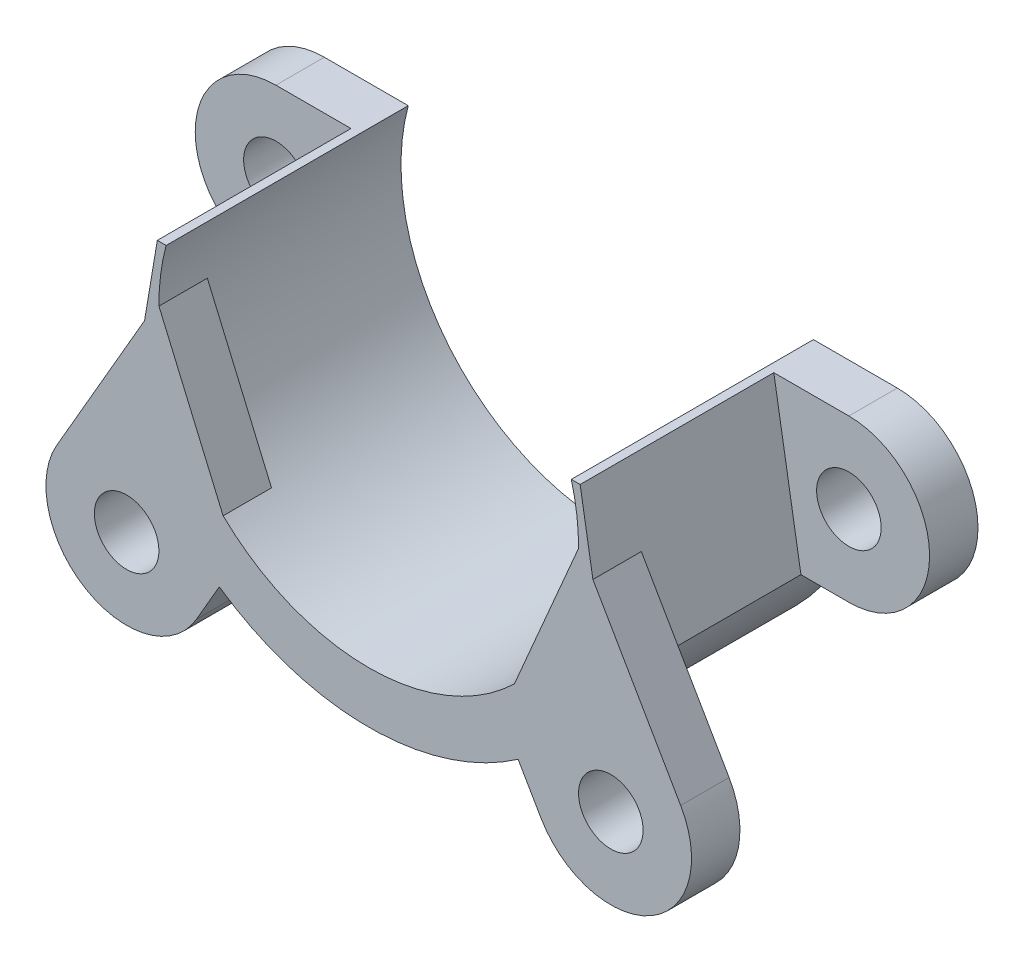
ISO-10303-21;
HEADER;
FILE_DESCRIPTION(('STEP AP214'),'2;1');
FILE_NAME('part.step','',(''),(''),'','','');
FILE_SCHEMA(('AUTOMOTIVE_DESIGN { 1 0 10303 214 1 1 1 1 }'));
ENDSEC;
DATA;
#1=APPLICATION_CONTEXT('core data for automotive mechanical design processes');
#2=APPLICATION_PROTOCOL_DEFINITION('international standard','automotive_design',2000,#1);
#3=PRODUCT_CONTEXT('',#1,'mechanical');
#4=PRODUCT('Part','Part','',(#3));
#5=PRODUCT_RELATED_PRODUCT_CATEGORY('part','',(#4));
#6=PRODUCT_DEFINITION_FORMATION('','',#4);
#7=PRODUCT_DEFINITION_CONTEXT('part definition',#1,'design');
#8=PRODUCT_DEFINITION('design','',#6,#7);
#9=PRODUCT_DEFINITION_SHAPE('','',#8);
#10=(LENGTH_UNIT() NAMED_UNIT(*) SI_UNIT(.MILLI.,.METRE.));
#11=(NAMED_UNIT(*) PLANE_ANGLE_UNIT() SI_UNIT($,.RADIAN.));
#12=(NAMED_UNIT(*) SI_UNIT($,.STERADIAN.) SOLID_ANGLE_UNIT());
#13=UNCERTAINTY_MEASURE_WITH_UNIT(LENGTH_MEASURE(1.E-05),#10,'distance_accuracy_value','');
#14=(GEOMETRIC_REPRESENTATION_CONTEXT(3) GLOBAL_UNCERTAINTY_ASSIGNED_CONTEXT((#13)) GLOBAL_UNIT_ASSIGNED_CONTEXT((#10,
#11,#12)) REPRESENTATION_CONTEXT('',''));
#15=CARTESIAN_POINT('',(0.,0.,0.));
#16=DIRECTION('',(0.,0.,1.));
#17=DIRECTION('',(1.,0.,0.));
#18=AXIS2_PLACEMENT_3D('',#15,#16,#17);
#19=CARTESIAN_POINT('',(0.,0.,3.));
#20=DIRECTION('',(0.,0.,1.));
#21=DIRECTION('',(1.,0.,0.));
#22=AXIS2_PLACEMENT_3D('',#19,#20,#21);
#23=PLANE('',#22);
#24=DIRECTION('',(-0.165720786741634,-0.986172713494819,0.));
#25=VECTOR('',#24,1.);
#26=CARTESIAN_POINT('',(-14.7795611567183,-6.61707257474387,3.));
#27=LINE('',#26,#25);
#28=CARTESIAN_POINT('',(-13.0991173107884,3.38292742525613,3.));
#29=VERTEX_POINT('',#28);
#30=CARTESIAN_POINT('',(-14.7795611567183,-6.61707257474387,3.));
#31=VERTEX_POINT('',#30);
#32=EDGE_CURVE('E293',#29,#31,#27,.T.);
#33=ORIENTED_EDGE('',*,*,#32,.F.);
#34=DIRECTION('',(-1.,0.,0.));
#35=VECTOR('',#34,1.);
#36=CARTESIAN_POINT('',(-13.0991173107884,3.38292742525613,3.));
#37=LINE('',#36,#35);
#38=CARTESIAN_POINT('',(-17.75,3.38292742525613,3.));
#39=VERTEX_POINT('',#38);
#40=EDGE_CURVE('E341',#29,#39,#37,.T.);
#41=ORIENTED_EDGE('',*,*,#40,.T.);
#42=CARTESIAN_POINT('',(-17.75,-1.61707257474387,3.));
#43=DIRECTION('',(0.,0.,1.));
#44=DIRECTION('',(1.,0.,0.));
#45=AXIS2_PLACEMENT_3D('',#42,#43,#44);
#46=CIRCLE('',#45,5.);
#47=CARTESIAN_POINT('',(-17.75,-6.61707257474387,3.));
#48=VERTEX_POINT('',#47);
#49=EDGE_CURVE('E343',#39,#48,#46,.T.);
#50=ORIENTED_EDGE('',*,*,#49,.T.);
#51=DIRECTION('',(1.,0.,0.));
#52=VECTOR('',#51,1.);
#53=CARTESIAN_POINT('',(-17.75,-6.61707257474387,3.));
#54=LINE('',#53,#52);
#55=EDGE_CURVE('E345',#48,#31,#54,.T.);
#56=ORIENTED_EDGE('',*,*,#55,.T.);
#57=EDGE_LOOP('',(#33,#41,#50,#56));
#58=FACE_BOUND('',#57,.T.);
#59=CARTESIAN_POINT('',(-17.75,-1.61707257474387,3.));
#60=DIRECTION('',(0.,0.,1.));
#61=DIRECTION('',(1.,0.,0.));
#62=AXIS2_PLACEMENT_3D('',#59,#60,#61);
#63=CIRCLE('',#62,2.);
#64=CARTESIAN_POINT('',(-15.75,-1.61707257474387,3.));
#65=VERTEX_POINT('',#64);
#66=EDGE_CURVE('E328',#65,#65,#63,.T.);
#67=ORIENTED_EDGE('',*,*,#66,.F.);
#68=EDGE_LOOP('',(#67));
#69=FACE_BOUND('',#68,.T.);
#70=ADVANCED_FACE('F32',(#58,#69),#23,.T.);
#71=DIRECTION('',(-0.165720786741634,0.986172713494819,0.));
#72=VECTOR('',#71,1.);
#73=CARTESIAN_POINT('',(13.0991173107884,3.38292742525613,3.));
#74=LINE('',#73,#72);
#75=CARTESIAN_POINT('',(14.7795611567183,-6.61707257474387,3.));
#76=VERTEX_POINT('',#75);
#77=CARTESIAN_POINT('',(13.0991173107884,3.38292742525613,3.));
#78=VERTEX_POINT('',#77);
#79=EDGE_CURVE('E289',#76,#78,#74,.T.);
#80=ORIENTED_EDGE('',*,*,#79,.F.);
#81=DIRECTION('',(1.,0.,0.));
#82=VECTOR('',#81,1.);
#83=CARTESIAN_POINT('',(14.7795611567183,-6.61707257474387,3.));
#84=LINE('',#83,#82);
#85=CARTESIAN_POINT('',(17.75,-6.61707257474387,3.));
#86=VERTEX_POINT('',#85);
#87=EDGE_CURVE('E334',#76,#86,#84,.T.);
#88=ORIENTED_EDGE('',*,*,#87,.T.);
#89=CARTESIAN_POINT('',(17.75,-1.61707257474387,3.));
#90=DIRECTION('',(0.,0.,1.));
#91=DIRECTION('',(1.,0.,0.));
#92=AXIS2_PLACEMENT_3D('',#89,#90,#91);
#93=CIRCLE('',#92,5.);
#94=CARTESIAN_POINT('',(17.75,3.38292742525613,3.));
#95=VERTEX_POINT('',#94);
#96=EDGE_CURVE('E336',#86,#95,#93,.T.);
#97=ORIENTED_EDGE('',*,*,#96,.T.);
#98=DIRECTION('',(-1.,0.,0.));
#99=VECTOR('',#98,1.);
#100=CARTESIAN_POINT('',(17.75,3.38292742525613,3.));
#101=LINE('',#100,#99);
#102=EDGE_CURVE('E339',#95,#78,#101,.T.);
#103=ORIENTED_EDGE('',*,*,#102,.T.);
#104=EDGE_LOOP('',(#80,#88,#97,#103));
#105=FACE_BOUND('',#104,.T.);
#106=CARTESIAN_POINT('',(17.75,-1.61707257474387,3.));
#107=DIRECTION('',(0.,0.,1.));
#108=DIRECTION('',(1.,0.,0.));
#109=AXIS2_PLACEMENT_3D('',#106,#107,#108);
#110=CIRCLE('',#109,2.);
#111=CARTESIAN_POINT('',(19.75,-1.61707257474387,3.));
#112=VERTEX_POINT('',#111);
#113=EDGE_CURVE('E322',#112,#112,#110,.T.);
#114=ORIENTED_EDGE('',*,*,#113,.F.);
#115=EDGE_LOOP('',(#114));
#116=FACE_BOUND('',#115,.T.);
#117=ADVANCED_FACE('F420',(#105,#116),#23,.T.);
#118=CARTESIAN_POINT('',(0.,0.,0.));
#119=DIRECTION('',(0.,0.,1.));
#120=DIRECTION('',(1.,0.,0.));
#121=AXIS2_PLACEMENT_3D('',#118,#119,#120);
#122=PLANE('',#121);
#123=CARTESIAN_POINT('',(0.,0.,0.));
#124=DIRECTION('',(0.,0.,1.));
#125=DIRECTION('',(1.,0.,0.));
#126=AXIS2_PLACEMENT_3D('',#123,#124,#125);
#127=CIRCLE('',#126,16.1932417213047);
#128=CARTESIAN_POINT('',(-14.7795611567183,-6.61707257474387,0.));
#129=VERTEX_POINT('',#128);
#130=CARTESIAN_POINT('',(14.7795611567183,-6.61707257474387,0.));
#131=VERTEX_POINT('',#130);
#132=EDGE_CURVE('E331',#129,#131,#127,.T.);
#133=ORIENTED_EDGE('',*,*,#132,.F.);
#134=DIRECTION('',(1.,0.,0.));
#135=VECTOR('',#134,1.);
#136=CARTESIAN_POINT('',(-17.75,-6.61707257474387,0.));
#137=LINE('',#136,#135);
#138=CARTESIAN_POINT('',(-17.75,-6.61707257474387,0.));
#139=VERTEX_POINT('',#138);
#140=EDGE_CURVE('E337',#139,#129,#137,.T.);
#141=ORIENTED_EDGE('',*,*,#140,.F.);
#142=CARTESIAN_POINT('',(-17.75,-1.61707257474387,0.));
#143=DIRECTION('',(0.,0.,1.));
#144=DIRECTION('',(1.,0.,0.));
#145=AXIS2_PLACEMENT_3D('',#142,#143,#144);
#146=CIRCLE('',#145,5.);
#147=CARTESIAN_POINT('',(-17.75,3.38292742525613,0.));
#148=VERTEX_POINT('',#147);
#149=EDGE_CURVE('E363',#148,#139,#146,.T.);
#150=ORIENTED_EDGE('',*,*,#149,.F.);
#151=DIRECTION('',(-1.,0.,0.));
#152=VECTOR('',#151,1.);
#153=CARTESIAN_POINT('',(-17.75,3.38292742525613,0.));
#154=LINE('',#153,#152);
#155=CARTESIAN_POINT('',(-12.5521234074339,3.38292742525613,0.));
#156=VERTEX_POINT('',#155);
#157=EDGE_CURVE('E361',#156,#148,#154,.T.);
#158=ORIENTED_EDGE('',*,*,#157,.F.);
#159=CARTESIAN_POINT('',(0.,0.,0.));
#160=DIRECTION('',(0.,0.,-1.));
#161=DIRECTION('',(1.,0.,0.));
#162=AXIS2_PLACEMENT_3D('',#159,#160,#161);
#163=CIRCLE('',#162,13.);
#164=CARTESIAN_POINT('',(12.5521234074339,3.38292742525613,0.));
#165=VERTEX_POINT('',#164);
#166=EDGE_CURVE('E358',#165,#156,#163,.T.);
#167=ORIENTED_EDGE('',*,*,#166,.F.);
#168=DIRECTION('',(-1.,0.,0.));
#169=VECTOR('',#168,1.);
#170=CARTESIAN_POINT('',(12.5521234074339,3.38292742525613,0.));
#171=LINE('',#170,#169);
#172=CARTESIAN_POINT('',(17.75,3.38292742525613,0.));
#173=VERTEX_POINT('',#172);
#174=EDGE_CURVE('E356',#173,#165,#171,.T.);
#175=ORIENTED_EDGE('',*,*,#174,.F.);
#176=CARTESIAN_POINT('',(17.75,-1.61707257474387,0.));
#177=DIRECTION('',(0.,0.,1.));
#178=DIRECTION('',(1.,0.,0.));
#179=AXIS2_PLACEMENT_3D('',#176,#177,#178);
#180=CIRCLE('',#179,5.);
#181=CARTESIAN_POINT('',(17.75,-6.61707257474387,0.));
#182=VERTEX_POINT('',#181);
#183=EDGE_CURVE('E353',#182,#173,#180,.T.);
#184=ORIENTED_EDGE('',*,*,#183,.F.);
#185=DIRECTION('',(1.,0.,0.));
#186=VECTOR('',#185,1.);
#187=CARTESIAN_POINT('',(14.7795611567183,-6.61707257474387,0.));
#188=LINE('',#187,#186);
#189=EDGE_CURVE('E351',#131,#182,#188,.T.);
#190=ORIENTED_EDGE('',*,*,#189,.F.);
#191=EDGE_LOOP('',(#133,#141,#150,#158,#167,#175,#184,#190));
#192=FACE_BOUND('',#191,.T.);
#193=CARTESIAN_POINT('',(-17.75,-1.61707257474387,0.));
#194=DIRECTION('',(0.,0.,1.));
#195=DIRECTION('',(1.,0.,0.));
#196=AXIS2_PLACEMENT_3D('',#193,#194,#195);
#197=CIRCLE('',#196,2.);
#198=CARTESIAN_POINT('',(-15.75,-1.61707257474387,0.));
#199=VERTEX_POINT('',#198);
#200=EDGE_CURVE('E325',#199,#199,#197,.T.);
#201=ORIENTED_EDGE('',*,*,#200,.T.);
#202=EDGE_LOOP('',(#201));
#203=FACE_BOUND('',#202,.T.);
#204=CARTESIAN_POINT('',(17.75,-1.61707257474387,0.));
#205=DIRECTION('',(0.,0.,1.));
#206=DIRECTION('',(1.,0.,0.));
#207=AXIS2_PLACEMENT_3D('',#204,#205,#206);
#208=CIRCLE('',#207,2.);
#209=CARTESIAN_POINT('',(19.75,-1.61707257474387,0.));
#210=VERTEX_POINT('',#209);
#211=EDGE_CURVE('E321',#210,#210,#208,.T.);
#212=ORIENTED_EDGE('',*,*,#211,.T.);
#213=EDGE_LOOP('',(#212));
#214=FACE_BOUND('',#213,.T.);
#215=ADVANCED_FACE('F439',(#192,#203,#214),#122,.F.);
#216=CARTESIAN_POINT('',(0.,0.,3.));
#217=DIRECTION('',(0.,0.,-1.));
#218=DIRECTION('',(-1.,0.,0.));
#219=AXIS2_PLACEMENT_3D('',#216,#217,#218);
#220=CYLINDRICAL_SURFACE('',#219,16.1932417213047);
#221=CARTESIAN_POINT('',(0.,0.,15.));
#222=DIRECTION('',(0.,0.,1.));
#223=DIRECTION('',(1.,0.,0.));
#224=AXIS2_PLACEMENT_3D('',#221,#222,#223);
#225=CIRCLE('',#224,16.1932417213047);
#226=CARTESIAN_POINT('',(-9.25730314163379,-13.2862114987118,15.));
#227=VERTEX_POINT('',#226);
#228=CARTESIAN_POINT('',(9.25730314163379,-13.2862114987118,15.));
#229=VERTEX_POINT('',#228);
#230=EDGE_CURVE('E290',#227,#229,#225,.T.);
#231=ORIENTED_EDGE('',*,*,#230,.F.);
#232=DIRECTION('',(0.,0.,-1.));
#233=VECTOR('',#232,1.);
#234=CARTESIAN_POINT('',(-9.25730314163378,-13.2862114987118,3.));
#235=LINE('',#234,#233);
#236=CARTESIAN_POINT('',(-9.25730314163378,-13.2862114987118,12.));
#237=VERTEX_POINT('',#236);
#238=EDGE_CURVE('E227',#227,#237,#235,.T.);
#239=ORIENTED_EDGE('',*,*,#238,.T.);
#240=CARTESIAN_POINT('',(0.,0.,12.));
#241=DIRECTION('',(0.,0.,-1.));
#242=DIRECTION('',(-1.,0.,0.));
#243=AXIS2_PLACEMENT_3D('',#240,#241,#242);
#244=CIRCLE('',#243,16.1932417213047);
#245=CARTESIAN_POINT('',(-14.7795611567183,-6.61707257474387,12.));
#246=VERTEX_POINT('',#245);
#247=EDGE_CURVE('E206',#237,#246,#244,.T.);
#248=ORIENTED_EDGE('',*,*,#247,.T.);
#249=DIRECTION('',(0.,0.,-1.));
#250=VECTOR('',#249,1.);
#251=CARTESIAN_POINT('',(-14.7795611567183,-6.61707257474387,15.));
#252=LINE('',#251,#250);
#253=EDGE_CURVE('E307',#246,#31,#252,.T.);
#254=ORIENTED_EDGE('',*,*,#253,.T.);
#255=DIRECTION('',(0.,0.,-1.));
#256=VECTOR('',#255,1.);
#257=CARTESIAN_POINT('',(-14.7795611567183,-6.61707257474387,3.));
#258=LINE('',#257,#256);
#259=EDGE_CURVE('E348',#31,#129,#258,.T.);
#260=ORIENTED_EDGE('',*,*,#259,.T.);
#261=ORIENTED_EDGE('',*,*,#132,.T.);
#262=DIRECTION('',(0.,0.,-1.));
#263=VECTOR('',#262,1.);
#264=CARTESIAN_POINT('',(14.7795611567183,-6.61707257474387,3.));
#265=LINE('',#264,#263);
#266=EDGE_CURVE('E386',#76,#131,#265,.T.);
#267=ORIENTED_EDGE('',*,*,#266,.F.);
#268=DIRECTION('',(0.,0.,-1.));
#269=VECTOR('',#268,1.);
#270=CARTESIAN_POINT('',(14.7795611567183,-6.61707257474387,15.));
#271=LINE('',#270,#269);
#272=CARTESIAN_POINT('',(14.7795611567183,-6.61707257474387,12.));
#273=VERTEX_POINT('',#272);
#274=EDGE_CURVE('E319',#273,#76,#271,.T.);
#275=ORIENTED_EDGE('',*,*,#274,.F.);
#276=CARTESIAN_POINT('',(0.,0.,12.));
#277=DIRECTION('',(0.,0.,1.));
#278=DIRECTION('',(1.,0.,0.));
#279=AXIS2_PLACEMENT_3D('',#276,#277,#278);
#280=CIRCLE('',#279,16.1932417213047);
#281=CARTESIAN_POINT('',(9.25730314163378,-13.2862114987118,12.));
#282=VERTEX_POINT('',#281);
#283=EDGE_CURVE('E285',#282,#273,#280,.T.);
#284=ORIENTED_EDGE('',*,*,#283,.F.);
#285=DIRECTION('',(0.,0.,-1.));
#286=VECTOR('',#285,1.);
#287=CARTESIAN_POINT('',(9.25730314163378,-13.2862114987118,3.));
#288=LINE('',#287,#286);
#289=EDGE_CURVE('E279',#282,#229,#288,.F.);
#290=ORIENTED_EDGE('',*,*,#289,.T.);
#291=EDGE_LOOP('',(#231,#239,#248,#254,#260,#261,#267,#275,#284,#290));
#292=FACE_BOUND('',#291,.T.);
#293=ADVANCED_FACE('F34',(#292),#220,.T.);
#294=CARTESIAN_POINT('',(14.7795611567183,-6.61707257474387,3.));
#295=DIRECTION('',(0.,1.,0.));
#296=DIRECTION('',(0.,0.,1.));
#297=AXIS2_PLACEMENT_3D('',#294,#295,#296);
#298=PLANE('',#297);
#299=ORIENTED_EDGE('',*,*,#189,.T.);
#300=DIRECTION('',(0.,0.,-1.));
#301=VECTOR('',#300,1.);
#302=CARTESIAN_POINT('',(17.75,-6.61707257474387,3.));
#303=LINE('',#302,#301);
#304=EDGE_CURVE('E383',#86,#182,#303,.T.);
#305=ORIENTED_EDGE('',*,*,#304,.F.);
#306=ORIENTED_EDGE('',*,*,#87,.F.);
#307=ORIENTED_EDGE('',*,*,#266,.T.);
#308=EDGE_LOOP('',(#299,#305,#306,#307));
#309=FACE_BOUND('',#308,.T.);
#310=ADVANCED_FACE('F425',(#309),#298,.F.);
#311=CARTESIAN_POINT('',(17.75,-1.61707257474387,3.));
#312=DIRECTION('',(0.,0.,-1.));
#313=DIRECTION('',(-1.,0.,0.));
#314=AXIS2_PLACEMENT_3D('',#311,#312,#313);
#315=CYLINDRICAL_SURFACE('',#314,5.);
#316=ORIENTED_EDGE('',*,*,#183,.T.);
#317=DIRECTION('',(0.,0.,-1.));
#318=VECTOR('',#317,1.);
#319=CARTESIAN_POINT('',(17.75,3.38292742525613,3.));
#320=LINE('',#319,#318);
#321=EDGE_CURVE('E380',#95,#173,#320,.T.);
#322=ORIENTED_EDGE('',*,*,#321,.F.);
#323=ORIENTED_EDGE('',*,*,#96,.F.);
#324=ORIENTED_EDGE('',*,*,#304,.T.);
#325=EDGE_LOOP('',(#316,#322,#323,#324));
#326=FACE_BOUND('',#325,.T.);
#327=ADVANCED_FACE('F430',(#326),#315,.T.);
#328=CARTESIAN_POINT('',(12.5521234074339,3.38292742525613,3.));
#329=DIRECTION('',(0.,-1.,0.));
#330=DIRECTION('',(0.,0.,-1.));
#331=AXIS2_PLACEMENT_3D('',#328,#329,#330);
#332=PLANE('',#331);
#333=ORIENTED_EDGE('',*,*,#174,.T.);
#334=DIRECTION('',(0.,0.,-1.));
#335=VECTOR('',#334,1.);
#336=CARTESIAN_POINT('',(12.5521234074339,3.38292742525613,3.));
#337=LINE('',#336,#335);
#338=CARTESIAN_POINT('',(12.5521234074339,3.38292742525613,15.));
#339=VERTEX_POINT('',#338);
#340=EDGE_CURVE('E377',#339,#165,#337,.T.);
#341=ORIENTED_EDGE('',*,*,#340,.F.);
#342=DIRECTION('',(-1.,0.,0.));
#343=VECTOR('',#342,1.);
#344=CARTESIAN_POINT('',(12.5521234074339,3.38292742525613,15.));
#345=LINE('',#344,#343);
#346=CARTESIAN_POINT('',(13.0991173107884,3.38292742525613,15.));
#347=VERTEX_POINT('',#346);
#348=EDGE_CURVE('E295',#347,#339,#345,.T.);
#349=ORIENTED_EDGE('',*,*,#348,.F.);
#350=DIRECTION('',(0.,0.,-1.));
#351=VECTOR('',#350,1.);
#352=CARTESIAN_POINT('',(13.0991173107884,3.38292742525613,15.));
#353=LINE('',#352,#351);
#354=EDGE_CURVE('E316',#347,#78,#353,.T.);
#355=ORIENTED_EDGE('',*,*,#354,.T.);
#356=ORIENTED_EDGE('',*,*,#102,.F.);
#357=ORIENTED_EDGE('',*,*,#321,.T.);
#358=EDGE_LOOP('',(#333,#341,#349,#355,#356,#357));
#359=FACE_BOUND('',#358,.T.);
#360=ADVANCED_FACE('F432',(#359),#332,.F.);
#361=CARTESIAN_POINT('',(0.,0.,3.));
#362=DIRECTION('',(0.,0.,-1.));
#363=DIRECTION('',(-1.,0.,0.));
#364=AXIS2_PLACEMENT_3D('',#361,#362,#363);
#365=CYLINDRICAL_SURFACE('',#364,13.);
#366=CARTESIAN_POINT('',(0.,0.,12.));
#367=DIRECTION('',(0.,0.,-1.));
#368=DIRECTION('',(-1.,0.,0.));
#369=AXIS2_PLACEMENT_3D('',#366,#367,#368);
#370=CIRCLE('',#369,13.);
#371=CARTESIAN_POINT('',(-12.9996375756716,-0.0970716291515588,12.));
#372=VERTEX_POINT('',#371);
#373=CARTESIAN_POINT('',(-9.02238954104811,-9.35929949139281,12.));
#374=VERTEX_POINT('',#373);
#375=EDGE_CURVE('E240',#372,#374,#370,.F.);
#376=ORIENTED_EDGE('',*,*,#375,.T.);
#377=DIRECTION('',(0.,0.,-1.));
#378=VECTOR('',#377,1.);
#379=CARTESIAN_POINT('',(-9.02238954104811,-9.35929949139281,3.));
#380=LINE('',#379,#378);
#381=CARTESIAN_POINT('',(-9.02238954104811,-9.35929949139281,15.));
#382=VERTEX_POINT('',#381);
#383=EDGE_CURVE('E233',#374,#382,#380,.F.);
#384=ORIENTED_EDGE('',*,*,#383,.T.);
#385=CARTESIAN_POINT('',(0.,0.,15.));
#386=DIRECTION('',(0.,0.,-1.));
#387=DIRECTION('',(1.,0.,0.));
#388=AXIS2_PLACEMENT_3D('',#385,#386,#387);
#389=CIRCLE('',#388,13.);
#390=CARTESIAN_POINT('',(9.02238954104811,-9.35929949139281,15.));
#391=VERTEX_POINT('',#390);
#392=EDGE_CURVE('E302',#391,#382,#389,.T.);
#393=ORIENTED_EDGE('',*,*,#392,.F.);
#394=DIRECTION('',(0.,0.,-1.));
#395=VECTOR('',#394,1.);
#396=CARTESIAN_POINT('',(9.02238954104811,-9.35929949139281,3.));
#397=LINE('',#396,#395);
#398=CARTESIAN_POINT('',(9.02238954104811,-9.35929949139281,12.));
#399=VERTEX_POINT('',#398);
#400=EDGE_CURVE('E271',#391,#399,#397,.T.);
#401=ORIENTED_EDGE('',*,*,#400,.T.);
#402=CARTESIAN_POINT('',(0.,0.,12.));
#403=DIRECTION('',(0.,0.,1.));
#404=DIRECTION('',(1.,0.,0.));
#405=AXIS2_PLACEMENT_3D('',#402,#403,#404);
#406=CIRCLE('',#405,13.);
#407=CARTESIAN_POINT('',(12.9996375756716,-0.0970716291515588,12.));
#408=VERTEX_POINT('',#407);
#409=EDGE_CURVE('E287',#408,#399,#406,.F.);
#410=ORIENTED_EDGE('',*,*,#409,.F.);
#411=DIRECTION('',(0.,0.,-1.));
#412=VECTOR('',#411,1.);
#413=CARTESIAN_POINT('',(12.9996375756716,-0.0970716291515588,3.));
#414=LINE('',#413,#412);
#415=CARTESIAN_POINT('',(12.9996375756716,-0.0970716291515628,15.));
#416=VERTEX_POINT('',#415);
#417=EDGE_CURVE('E276',#408,#416,#414,.F.);
#418=ORIENTED_EDGE('',*,*,#417,.T.);
#419=EDGE_CURVE('E299',#339,#416,#389,.T.);
#420=ORIENTED_EDGE('',*,*,#419,.F.);
#421=ORIENTED_EDGE('',*,*,#340,.T.);
#422=ORIENTED_EDGE('',*,*,#166,.T.);
#423=DIRECTION('',(0.,0.,-1.));
#424=VECTOR('',#423,1.);
#425=CARTESIAN_POINT('',(-12.5521234074339,3.38292742525613,3.));
#426=LINE('',#425,#424);
#427=CARTESIAN_POINT('',(-12.5521234074339,3.38292742525613,15.));
#428=VERTEX_POINT('',#427);
#429=EDGE_CURVE('E374',#428,#156,#426,.T.);
#430=ORIENTED_EDGE('',*,*,#429,.F.);
#431=CARTESIAN_POINT('',(-12.9996375756716,-0.0970716291515648,15.));
#432=VERTEX_POINT('',#431);
#433=EDGE_CURVE('E298',#432,#428,#389,.T.);
#434=ORIENTED_EDGE('',*,*,#433,.F.);
#435=DIRECTION('',(0.,0.,-1.));
#436=VECTOR('',#435,1.);
#437=CARTESIAN_POINT('',(-12.9996375756716,-0.0970716291515588,3.));
#438=LINE('',#437,#436);
#439=EDGE_CURVE('E230',#432,#372,#438,.T.);
#440=ORIENTED_EDGE('',*,*,#439,.T.);
#441=EDGE_LOOP('',(#376,#384,#393,#401,#410,#418,#420,#421,#422,#430,#434,#440));
#442=FACE_BOUND('',#441,.T.);
#443=ADVANCED_FACE('F435',(#442),#365,.F.);
#444=CARTESIAN_POINT('',(-17.75,3.38292742525613,3.));
#445=DIRECTION('',(0.,-1.,0.));
#446=DIRECTION('',(1.,0.,0.));
#447=AXIS2_PLACEMENT_3D('',#444,#445,#446);
#448=PLANE('',#447);
#449=ORIENTED_EDGE('',*,*,#157,.T.);
#450=DIRECTION('',(0.,0.,-1.));
#451=VECTOR('',#450,1.);
#452=CARTESIAN_POINT('',(-17.75,3.38292742525613,3.));
#453=LINE('',#452,#451);
#454=EDGE_CURVE('E371',#39,#148,#453,.T.);
#455=ORIENTED_EDGE('',*,*,#454,.F.);
#456=ORIENTED_EDGE('',*,*,#40,.F.);
#457=DIRECTION('',(0.,0.,-1.));
#458=VECTOR('',#457,1.);
#459=CARTESIAN_POINT('',(-13.0991173107884,3.38292742525613,15.));
#460=LINE('',#459,#458);
#461=CARTESIAN_POINT('',(-13.0991173107884,3.38292742525613,15.));
#462=VERTEX_POINT('',#461);
#463=EDGE_CURVE('E313',#462,#29,#460,.T.);
#464=ORIENTED_EDGE('',*,*,#463,.F.);
#465=DIRECTION('',(-1.,0.,0.));
#466=VECTOR('',#465,1.);
#467=CARTESIAN_POINT('',(-13.0991173107884,3.38292742525613,15.));
#468=LINE('',#467,#466);
#469=EDGE_CURVE('E301',#428,#462,#468,.T.);
#470=ORIENTED_EDGE('',*,*,#469,.F.);
#471=ORIENTED_EDGE('',*,*,#429,.T.);
#472=EDGE_LOOP('',(#449,#455,#456,#464,#470,#471));
#473=FACE_BOUND('',#472,.T.);
#474=ADVANCED_FACE('F445',(#473),#448,.F.);
#475=CARTESIAN_POINT('',(-17.75,-1.61707257474387,3.));
#476=DIRECTION('',(0.,0.,-1.));
#477=DIRECTION('',(-1.,0.,0.));
#478=AXIS2_PLACEMENT_3D('',#475,#476,#477);
#479=CYLINDRICAL_SURFACE('',#478,5.);
#480=ORIENTED_EDGE('',*,*,#149,.T.);
#481=DIRECTION('',(0.,0.,-1.));
#482=VECTOR('',#481,1.);
#483=CARTESIAN_POINT('',(-17.75,-6.61707257474387,3.));
#484=LINE('',#483,#482);
#485=EDGE_CURVE('E368',#48,#139,#484,.T.);
#486=ORIENTED_EDGE('',*,*,#485,.F.);
#487=ORIENTED_EDGE('',*,*,#49,.F.);
#488=ORIENTED_EDGE('',*,*,#454,.T.);
#489=EDGE_LOOP('',(#480,#486,#487,#488));
#490=FACE_BOUND('',#489,.T.);
#491=ADVANCED_FACE('F450',(#490),#479,.T.);
#492=CARTESIAN_POINT('',(-17.75,-6.61707257474387,3.));
#493=DIRECTION('',(0.,1.,0.));
#494=DIRECTION('',(0.,0.,1.));
#495=AXIS2_PLACEMENT_3D('',#492,#493,#494);
#496=PLANE('',#495);
#497=ORIENTED_EDGE('',*,*,#140,.T.);
#498=ORIENTED_EDGE('',*,*,#259,.F.);
#499=ORIENTED_EDGE('',*,*,#55,.F.);
#500=ORIENTED_EDGE('',*,*,#485,.T.);
#501=EDGE_LOOP('',(#497,#498,#499,#500));
#502=FACE_BOUND('',#501,.T.);
#503=ADVANCED_FACE('F491',(#502),#496,.F.);
#504=CARTESIAN_POINT('',(-17.75,-1.61707257474387,3.));
#505=DIRECTION('',(0.,0.,-1.));
#506=DIRECTION('',(-1.,0.,0.));
#507=AXIS2_PLACEMENT_3D('',#504,#505,#506);
#508=CYLINDRICAL_SURFACE('',#507,2.);
#509=ORIENTED_EDGE('',*,*,#66,.T.);
#510=EDGE_LOOP('',(#509));
#511=FACE_BOUND('',#510,.T.);
#512=ORIENTED_EDGE('',*,*,#200,.F.);
#513=EDGE_LOOP('',(#512));
#514=FACE_BOUND('',#513,.T.);
#515=ADVANCED_FACE('F487',(#511,#514),#508,.F.);
#516=CARTESIAN_POINT('',(17.75,-1.61707257474387,3.));
#517=DIRECTION('',(0.,0.,-1.));
#518=DIRECTION('',(-1.,0.,0.));
#519=AXIS2_PLACEMENT_3D('',#516,#517,#518);
#520=CYLINDRICAL_SURFACE('',#519,2.);
#521=ORIENTED_EDGE('',*,*,#113,.T.);
#522=EDGE_LOOP('',(#521));
#523=FACE_BOUND('',#522,.T.);
#524=ORIENTED_EDGE('',*,*,#211,.F.);
#525=EDGE_LOOP('',(#524));
#526=FACE_BOUND('',#525,.T.);
#527=ADVANCED_FACE('F563',(#523,#526),#520,.F.);
#528=CARTESIAN_POINT('',(13.0991173107884,3.38292742525613,15.));
#529=DIRECTION('',(-0.986172713494819,-0.165720786741634,0.));
#530=DIRECTION('',(0.165720786741634,-0.986172713494819,0.));
#531=AXIS2_PLACEMENT_3D('',#528,#529,#530);
#532=PLANE('',#531);
#533=DIRECTION('',(-0.165720786741634,0.986172713494819,0.));
#534=VECTOR('',#533,1.);
#535=CARTESIAN_POINT('',(13.0991173107884,3.38292742525613,15.));
#536=LINE('',#535,#534);
#537=CARTESIAN_POINT('',(13.8896409579266,-1.32132763838624,15.));
#538=VERTEX_POINT('',#537);
#539=EDGE_CURVE('E292',#538,#347,#536,.T.);
#540=ORIENTED_EDGE('',*,*,#539,.F.);
#541=DIRECTION('',(0.,0.,-1.));
#542=VECTOR('',#541,1.);
#543=CARTESIAN_POINT('',(13.8896409579266,-1.32132763838623,15.));
#544=LINE('',#543,#542);
#545=CARTESIAN_POINT('',(13.8896409579266,-1.32132763838626,12.));
#546=VERTEX_POINT('',#545);
#547=EDGE_CURVE('E282',#538,#546,#544,.T.);
#548=ORIENTED_EDGE('',*,*,#547,.T.);
#549=DIRECTION('',(-0.165720786741634,0.986172713494819,0.));
#550=VECTOR('',#549,1.);
#551=CARTESIAN_POINT('',(13.0991173107884,3.38292742525613,12.));
#552=LINE('',#551,#550);
#553=EDGE_CURVE('E40',#273,#546,#552,.T.);
#554=ORIENTED_EDGE('',*,*,#553,.F.);
#555=ORIENTED_EDGE('',*,*,#274,.T.);
#556=ORIENTED_EDGE('',*,*,#79,.T.);
#557=ORIENTED_EDGE('',*,*,#354,.F.);
#558=EDGE_LOOP('',(#540,#548,#554,#555,#556,#557));
#559=FACE_BOUND('',#558,.T.);
#560=ADVANCED_FACE('F402',(#559),#532,.F.);
#561=CARTESIAN_POINT('',(-14.7795611567183,-6.61707257474387,15.));
#562=DIRECTION('',(0.986172713494819,-0.165720786741634,0.));
#563=DIRECTION('',(0.165720786741634,0.986172713494819,0.));
#564=AXIS2_PLACEMENT_3D('',#561,#562,#563);
#565=PLANE('',#564);
#566=DIRECTION('',(0.165720786741634,0.986172713494819,0.));
#567=VECTOR('',#566,1.);
#568=CARTESIAN_POINT('',(-14.7795611567183,-6.61707257474387,12.));
#569=LINE('',#568,#567);
#570=CARTESIAN_POINT('',(-13.8896409579266,-1.32132763838624,12.));
#571=VERTEX_POINT('',#570);
#572=EDGE_CURVE('E11',#246,#571,#569,.T.);
#573=ORIENTED_EDGE('',*,*,#572,.T.);
#574=DIRECTION('',(0.,0.,1.));
#575=VECTOR('',#574,1.);
#576=CARTESIAN_POINT('',(-13.8896409579266,-1.32132763838623,15.));
#577=LINE('',#576,#575);
#578=CARTESIAN_POINT('',(-13.8896409579266,-1.32132763838624,15.));
#579=VERTEX_POINT('',#578);
#580=EDGE_CURVE('E236',#571,#579,#577,.T.);
#581=ORIENTED_EDGE('',*,*,#580,.T.);
#582=DIRECTION('',(-0.165720786741634,-0.986172713494819,0.));
#583=VECTOR('',#582,1.);
#584=CARTESIAN_POINT('',(-14.7795611567183,-6.61707257474387,15.));
#585=LINE('',#584,#583);
#586=EDGE_CURVE('E304',#462,#579,#585,.T.);
#587=ORIENTED_EDGE('',*,*,#586,.F.);
#588=ORIENTED_EDGE('',*,*,#463,.T.);
#589=ORIENTED_EDGE('',*,*,#32,.T.);
#590=ORIENTED_EDGE('',*,*,#253,.F.);
#591=EDGE_LOOP('',(#573,#581,#587,#588,#589,#590));
#592=FACE_BOUND('',#591,.T.);
#593=ADVANCED_FACE('F459',(#592),#565,.F.);
#594=CARTESIAN_POINT('',(0.,0.,15.));
#595=DIRECTION('',(0.,0.,1.));
#596=DIRECTION('',(1.,0.,0.));
#597=AXIS2_PLACEMENT_3D('',#594,#595,#596);
#598=PLANE('',#597);
#599=DIRECTION('',(0.500628309746129,0.865662344959473,0.));
#600=VECTOR('',#599,1.);
#601=CARTESIAN_POINT('',(-10.6716882752026,-15.7318981040536,15.));
#602=LINE('',#601,#600);
#603=CARTESIAN_POINT('',(-10.6716882752026,-15.7318981040536,15.));
#604=VERTEX_POINT('',#603);
#605=EDGE_CURVE('E192',#604,#227,#602,.T.);
#606=ORIENTED_EDGE('',*,*,#605,.T.);
#607=ORIENTED_EDGE('',*,*,#230,.T.);
#608=DIRECTION('',(0.500628309746129,-0.865662344959473,0.));
#609=VECTOR('',#608,1.);
#610=CARTESIAN_POINT('',(10.6716882752026,-15.7318981040536,15.));
#611=LINE('',#610,#609);
#612=CARTESIAN_POINT('',(10.6716882752026,-15.7318981040536,15.));
#613=VERTEX_POINT('',#612);
#614=EDGE_CURVE('E265',#229,#613,#611,.T.);
#615=ORIENTED_EDGE('',*,*,#614,.T.);
#616=CARTESIAN_POINT('',(15.,-13.228756555323,15.));
#617=DIRECTION('',(0.,0.,1.));
#618=DIRECTION('',(1.,0.,0.));
#619=AXIS2_PLACEMENT_3D('',#616,#617,#618);
#620=CIRCLE('',#619,5.);
#621=CARTESIAN_POINT('',(19.3283117247974,-10.7256150065923,15.));
#622=VERTEX_POINT('',#621);
#623=EDGE_CURVE('E254',#613,#622,#620,.T.);
#624=ORIENTED_EDGE('',*,*,#623,.T.);
#625=DIRECTION('',(-0.500628309746128,0.865662344959474,0.));
#626=VECTOR('',#625,1.);
#627=CARTESIAN_POINT('',(19.3283117247974,-10.7256150065923,15.));
#628=LINE('',#627,#626);
#629=EDGE_CURVE('E247',#622,#538,#628,.T.);
#630=ORIENTED_EDGE('',*,*,#629,.T.);
#631=ORIENTED_EDGE('',*,*,#539,.T.);
#632=ORIENTED_EDGE('',*,*,#348,.T.);
#633=ORIENTED_EDGE('',*,*,#419,.T.);
#634=DIRECTION('',(-0.394566380032619,-0.918867439703875,0.));
#635=VECTOR('',#634,1.);
#636=CARTESIAN_POINT('',(13.0771877077478,0.0835273648723432,15.));
#637=LINE('',#636,#635);
#638=EDGE_CURVE('E53',#416,#391,#637,.T.);
#639=ORIENTED_EDGE('',*,*,#638,.T.);
#640=ORIENTED_EDGE('',*,*,#392,.T.);
#641=DIRECTION('',(-0.394566380032619,0.918867439703875,0.));
#642=VECTOR('',#641,1.);
#643=CARTESIAN_POINT('',(-13.0771877077478,0.0835273648723432,15.));
#644=LINE('',#643,#642);
#645=EDGE_CURVE('E47',#382,#432,#644,.T.);
#646=ORIENTED_EDGE('',*,*,#645,.T.);
#647=ORIENTED_EDGE('',*,*,#433,.T.);
#648=ORIENTED_EDGE('',*,*,#469,.T.);
#649=ORIENTED_EDGE('',*,*,#586,.T.);
#650=DIRECTION('',(-0.500628309746128,-0.865662344959474,0.));
#651=VECTOR('',#650,1.);
#652=CARTESIAN_POINT('',(-19.3283117247974,-10.7256150065923,15.));
#653=LINE('',#652,#651);
#654=CARTESIAN_POINT('',(-19.3283117247974,-10.7256150065923,15.));
#655=VERTEX_POINT('',#654);
#656=EDGE_CURVE('E212',#579,#655,#653,.T.);
#657=ORIENTED_EDGE('',*,*,#656,.T.);
#658=CARTESIAN_POINT('',(-15.,-13.228756555323,15.));
#659=DIRECTION('',(0.,0.,1.));
#660=DIRECTION('',(-1.,0.,0.));
#661=AXIS2_PLACEMENT_3D('',#658,#659,#660);
#662=CIRCLE('',#661,5.);
#663=EDGE_CURVE('E222',#655,#604,#662,.T.);
#664=ORIENTED_EDGE('',*,*,#663,.T.);
#665=EDGE_LOOP('',(#606,#607,#615,#624,#630,#631,#632,#633,#639,#640,#646,#647,#648,#649,#657,#664));
#666=FACE_BOUND('',#665,.T.);
#667=CARTESIAN_POINT('',(15.,-13.228756555323,15.));
#668=DIRECTION('',(0.,0.,1.));
#669=DIRECTION('',(-1.,0.,0.));
#670=AXIS2_PLACEMENT_3D('',#667,#668,#669);
#671=CIRCLE('',#670,2.);
#672=CARTESIAN_POINT('',(13.,-13.228756555323,15.));
#673=VERTEX_POINT('',#672);
#674=EDGE_CURVE('E243',#673,#673,#671,.T.);
#675=ORIENTED_EDGE('',*,*,#674,.F.);
#676=EDGE_LOOP('',(#675));
#677=FACE_BOUND('',#676,.T.);
#678=CARTESIAN_POINT('',(-15.,-13.228756555323,15.));
#679=DIRECTION('',(0.,0.,1.));
#680=DIRECTION('',(1.,0.,0.));
#681=AXIS2_PLACEMENT_3D('',#678,#679,#680);
#682=CIRCLE('',#681,2.);
#683=CARTESIAN_POINT('',(-13.,-13.228756555323,15.));
#684=VERTEX_POINT('',#683);
#685=EDGE_CURVE('E216',#684,#684,#682,.T.);
#686=ORIENTED_EDGE('',*,*,#685,.F.);
#687=EDGE_LOOP('',(#686));
#688=FACE_BOUND('',#687,.T.);
#689=ADVANCED_FACE('F405',(#666,#677,#688),#598,.T.);
#690=CARTESIAN_POINT('',(15.,-13.228756555323,12.));
#691=DIRECTION('',(0.,0.,1.));
#692=DIRECTION('',(1.,0.,0.));
#693=AXIS2_PLACEMENT_3D('',#690,#691,#692);
#694=CYLINDRICAL_SURFACE('',#693,2.);
#695=CARTESIAN_POINT('',(15.,-13.228756555323,12.));
#696=DIRECTION('',(0.,0.,1.));
#697=DIRECTION('',(-1.,0.,0.));
#698=AXIS2_PLACEMENT_3D('',#695,#696,#697);
#699=CIRCLE('',#698,2.);
#700=CARTESIAN_POINT('',(13.,-13.228756555323,12.));
#701=VERTEX_POINT('',#700);
#702=EDGE_CURVE('E244',#701,#701,#699,.T.);
#703=ORIENTED_EDGE('',*,*,#702,.F.);
#704=EDGE_LOOP('',(#703));
#705=FACE_BOUND('',#704,.T.);
#706=ORIENTED_EDGE('',*,*,#674,.T.);
#707=EDGE_LOOP('',(#706));
#708=FACE_BOUND('',#707,.T.);
#709=ADVANCED_FACE('F585',(#705,#708),#694,.F.);
#710=CARTESIAN_POINT('',(15.,-13.228756555323,12.));
#711=DIRECTION('',(0.,0.,1.));
#712=DIRECTION('',(1.,0.,0.));
#713=AXIS2_PLACEMENT_3D('',#710,#711,#712);
#714=CYLINDRICAL_SURFACE('',#713,5.);
#715=ORIENTED_EDGE('',*,*,#623,.F.);
#716=DIRECTION('',(0.,0.,1.));
#717=VECTOR('',#716,1.);
#718=CARTESIAN_POINT('',(10.6716882752026,-15.7318981040536,12.));
#719=LINE('',#718,#717);
#720=CARTESIAN_POINT('',(10.6716882752026,-15.7318981040536,12.));
#721=VERTEX_POINT('',#720);
#722=EDGE_CURVE('E262',#721,#613,#719,.T.);
#723=ORIENTED_EDGE('',*,*,#722,.F.);
#724=CARTESIAN_POINT('',(15.,-13.228756555323,12.));
#725=DIRECTION('',(0.,0.,1.));
#726=DIRECTION('',(1.,0.,0.));
#727=AXIS2_PLACEMENT_3D('',#724,#725,#726);
#728=CIRCLE('',#727,5.);
#729=CARTESIAN_POINT('',(19.3283117247974,-10.7256150065923,12.));
#730=VERTEX_POINT('',#729);
#731=EDGE_CURVE('E259',#721,#730,#728,.T.);
#732=ORIENTED_EDGE('',*,*,#731,.T.);
#733=DIRECTION('',(0.,0.,1.));
#734=VECTOR('',#733,1.);
#735=CARTESIAN_POINT('',(19.3283117247974,-10.7256150065923,12.));
#736=LINE('',#735,#734);
#737=EDGE_CURVE('E269',#730,#622,#736,.T.);
#738=ORIENTED_EDGE('',*,*,#737,.T.);
#739=EDGE_LOOP('',(#715,#723,#732,#738));
#740=FACE_BOUND('',#739,.T.);
#741=ADVANCED_FACE('F412',(#740),#714,.T.);
#742=CARTESIAN_POINT('',(10.6716882752026,-15.7318981040536,12.));
#743=DIRECTION('',(-0.865662344959473,-0.500628309746129,0.));
#744=DIRECTION('',(0.500628309746129,-0.865662344959473,0.));
#745=AXIS2_PLACEMENT_3D('',#742,#743,#744);
#746=PLANE('',#745);
#747=ORIENTED_EDGE('',*,*,#289,.F.);
#748=DIRECTION('',(0.500628309746129,-0.865662344959473,0.));
#749=VECTOR('',#748,1.);
#750=CARTESIAN_POINT('',(10.6716882752026,-15.7318981040536,12.));
#751=LINE('',#750,#749);
#752=EDGE_CURVE('E257',#282,#721,#751,.T.);
#753=ORIENTED_EDGE('',*,*,#752,.T.);
#754=ORIENTED_EDGE('',*,*,#722,.T.);
#755=ORIENTED_EDGE('',*,*,#614,.F.);
#756=EDGE_LOOP('',(#747,#753,#754,#755));
#757=FACE_BOUND('',#756,.T.);
#758=ADVANCED_FACE('F599',(#757),#746,.T.);
#759=CARTESIAN_POINT('',(19.3283117247974,-10.7256150065923,12.));
#760=DIRECTION('',(0.865662344959474,0.500628309746128,0.));
#761=DIRECTION('',(-0.500628309746128,0.865662344959474,0.));
#762=AXIS2_PLACEMENT_3D('',#759,#760,#761);
#763=PLANE('',#762);
#764=ORIENTED_EDGE('',*,*,#547,.F.);
#765=ORIENTED_EDGE('',*,*,#629,.F.);
#766=ORIENTED_EDGE('',*,*,#737,.F.);
#767=DIRECTION('',(-0.500628309746128,0.865662344959474,0.));
#768=VECTOR('',#767,1.);
#769=CARTESIAN_POINT('',(19.3283117247974,-10.7256150065923,12.));
#770=LINE('',#769,#768);
#771=EDGE_CURVE('E250',#730,#546,#770,.T.);
#772=ORIENTED_EDGE('',*,*,#771,.T.);
#773=EDGE_LOOP('',(#764,#765,#766,#772));
#774=FACE_BOUND('',#773,.T.);
#775=ADVANCED_FACE('F399',(#774),#763,.T.);
#776=CARTESIAN_POINT('',(15.,-13.228756555323,12.));
#777=DIRECTION('',(0.,0.,1.));
#778=DIRECTION('',(1.,0.,0.));
#779=AXIS2_PLACEMENT_3D('',#776,#777,#778);
#780=PLANE('',#779);
#781=ORIENTED_EDGE('',*,*,#702,.T.);
#782=EDGE_LOOP('',(#781));
#783=FACE_BOUND('',#782,.T.);
#784=ORIENTED_EDGE('',*,*,#752,.F.);
#785=ORIENTED_EDGE('',*,*,#283,.T.);
#786=ORIENTED_EDGE('',*,*,#553,.T.);
#787=ORIENTED_EDGE('',*,*,#771,.F.);
#788=ORIENTED_EDGE('',*,*,#731,.F.);
#789=EDGE_LOOP('',(#784,#785,#786,#787,#788));
#790=FACE_BOUND('',#789,.T.);
#791=ADVANCED_FACE('F392',(#783,#790),#780,.F.);
#792=DIRECTION('',(-0.394566380032619,-0.918867439703875,0.));
#793=VECTOR('',#792,1.);
#794=CARTESIAN_POINT('',(13.0771877077478,0.0835273648723432,12.));
#795=LINE('',#794,#793);
#796=EDGE_CURVE('E253',#408,#399,#795,.T.);
#797=ORIENTED_EDGE('',*,*,#796,.F.);
#798=ORIENTED_EDGE('',*,*,#409,.T.);
#799=EDGE_LOOP('',(#797,#798));
#800=FACE_BOUND('',#799,.T.);
#801=ADVANCED_FACE('F618',(#800),#780,.F.);
#802=CARTESIAN_POINT('',(13.0771877077478,0.0835273648723432,12.));
#803=DIRECTION('',(-0.918867439703875,0.394566380032619,0.));
#804=DIRECTION('',(-0.394566380032619,-0.918867439703876,0.));
#805=AXIS2_PLACEMENT_3D('',#802,#803,#804);
#806=PLANE('',#805);
#807=ORIENTED_EDGE('',*,*,#417,.F.);
#808=ORIENTED_EDGE('',*,*,#796,.T.);
#809=ORIENTED_EDGE('',*,*,#400,.F.);
#810=ORIENTED_EDGE('',*,*,#638,.F.);
#811=EDGE_LOOP('',(#807,#808,#809,#810));
#812=FACE_BOUND('',#811,.T.);
#813=ADVANCED_FACE('F626',(#812),#806,.T.);
#814=CARTESIAN_POINT('',(-15.,-13.228756555323,12.));
#815=DIRECTION('',(0.,0.,1.));
#816=DIRECTION('',(1.,0.,0.));
#817=AXIS2_PLACEMENT_3D('',#814,#815,#816);
#818=CYLINDRICAL_SURFACE('',#817,2.);
#819=CARTESIAN_POINT('',(-15.,-13.228756555323,12.));
#820=DIRECTION('',(0.,0.,1.));
#821=DIRECTION('',(1.,0.,0.));
#822=AXIS2_PLACEMENT_3D('',#819,#820,#821);
#823=CIRCLE('',#822,2.);
#824=CARTESIAN_POINT('',(-13.,-13.228756555323,12.));
#825=VERTEX_POINT('',#824);
#826=EDGE_CURVE('E224',#825,#825,#823,.T.);
#827=ORIENTED_EDGE('',*,*,#826,.F.);
#828=EDGE_LOOP('',(#827));
#829=FACE_BOUND('',#828,.T.);
#830=ORIENTED_EDGE('',*,*,#685,.T.);
#831=EDGE_LOOP('',(#830));
#832=FACE_BOUND('',#831,.T.);
#833=ADVANCED_FACE('F633',(#829,#832),#818,.F.);
#834=CARTESIAN_POINT('',(-15.,-13.228756555323,12.));
#835=DIRECTION('',(0.,0.,1.));
#836=DIRECTION('',(1.,0.,0.));
#837=AXIS2_PLACEMENT_3D('',#834,#835,#836);
#838=CYLINDRICAL_SURFACE('',#837,5.);
#839=ORIENTED_EDGE('',*,*,#663,.F.);
#840=DIRECTION('',(0.,0.,1.));
#841=VECTOR('',#840,1.);
#842=CARTESIAN_POINT('',(-19.3283117247974,-10.7256150065923,12.));
#843=LINE('',#842,#841);
#844=CARTESIAN_POINT('',(-19.3283117247974,-10.7256150065923,12.));
#845=VERTEX_POINT('',#844);
#846=EDGE_CURVE('E197',#845,#655,#843,.T.);
#847=ORIENTED_EDGE('',*,*,#846,.F.);
#848=CARTESIAN_POINT('',(-15.,-13.228756555323,12.));
#849=DIRECTION('',(0.,0.,1.));
#850=DIRECTION('',(-1.,0.,0.));
#851=AXIS2_PLACEMENT_3D('',#848,#849,#850);
#852=CIRCLE('',#851,5.);
#853=CARTESIAN_POINT('',(-10.6716882752026,-15.7318981040536,12.));
#854=VERTEX_POINT('',#853);
#855=EDGE_CURVE('E204',#845,#854,#852,.T.);
#856=ORIENTED_EDGE('',*,*,#855,.T.);
#857=DIRECTION('',(0.,0.,1.));
#858=VECTOR('',#857,1.);
#859=CARTESIAN_POINT('',(-10.6716882752026,-15.7318981040536,12.));
#860=LINE('',#859,#858);
#861=EDGE_CURVE('E186',#854,#604,#860,.T.);
#862=ORIENTED_EDGE('',*,*,#861,.T.);
#863=EDGE_LOOP('',(#839,#847,#856,#862));
#864=FACE_BOUND('',#863,.T.);
#865=ADVANCED_FACE('F210',(#864),#838,.T.);
#866=CARTESIAN_POINT('',(-10.6716882752026,-15.7318981040536,12.));
#867=DIRECTION('',(0.865662344959473,-0.500628309746129,0.));
#868=DIRECTION('',(0.500628309746129,0.865662344959473,0.));
#869=AXIS2_PLACEMENT_3D('',#866,#867,#868);
#870=PLANE('',#869);
#871=ORIENTED_EDGE('',*,*,#238,.F.);
#872=ORIENTED_EDGE('',*,*,#605,.F.);
#873=ORIENTED_EDGE('',*,*,#861,.F.);
#874=DIRECTION('',(0.500628309746129,0.865662344959473,0.));
#875=VECTOR('',#874,1.);
#876=CARTESIAN_POINT('',(-10.6716882752026,-15.7318981040536,12.));
#877=LINE('',#876,#875);
#878=EDGE_CURVE('E189',#854,#237,#877,.T.);
#879=ORIENTED_EDGE('',*,*,#878,.T.);
#880=EDGE_LOOP('',(#871,#872,#873,#879));
#881=FACE_BOUND('',#880,.T.);
#882=ADVANCED_FACE('F188',(#881),#870,.T.);
#883=CARTESIAN_POINT('',(-19.3283117247974,-10.7256150065923,12.));
#884=DIRECTION('',(-0.865662344959474,0.500628309746128,0.));
#885=DIRECTION('',(-0.500628309746128,-0.865662344959474,0.));
#886=AXIS2_PLACEMENT_3D('',#883,#884,#885);
#887=PLANE('',#886);
#888=ORIENTED_EDGE('',*,*,#580,.F.);
#889=DIRECTION('',(-0.500628309746128,-0.865662344959474,0.));
#890=VECTOR('',#889,1.);
#891=CARTESIAN_POINT('',(-19.3283117247974,-10.7256150065923,12.));
#892=LINE('',#891,#890);
#893=EDGE_CURVE('E198',#571,#845,#892,.T.);
#894=ORIENTED_EDGE('',*,*,#893,.T.);
#895=ORIENTED_EDGE('',*,*,#846,.T.);
#896=ORIENTED_EDGE('',*,*,#656,.F.);
#897=EDGE_LOOP('',(#888,#894,#895,#896));
#898=FACE_BOUND('',#897,.T.);
#899=ADVANCED_FACE('F476',(#898),#887,.T.);
#900=CARTESIAN_POINT('',(-15.,-13.228756555323,12.));
#901=DIRECTION('',(0.,0.,-1.));
#902=DIRECTION('',(-1.,0.,0.));
#903=AXIS2_PLACEMENT_3D('',#900,#901,#902);
#904=PLANE('',#903);
#905=ORIENTED_EDGE('',*,*,#826,.T.);
#906=EDGE_LOOP('',(#905));
#907=FACE_BOUND('',#906,.T.);
#908=ORIENTED_EDGE('',*,*,#247,.F.);
#909=ORIENTED_EDGE('',*,*,#878,.F.);
#910=ORIENTED_EDGE('',*,*,#855,.F.);
#911=ORIENTED_EDGE('',*,*,#893,.F.);
#912=ORIENTED_EDGE('',*,*,#572,.F.);
#913=EDGE_LOOP('',(#908,#909,#910,#911,#912));
#914=FACE_BOUND('',#913,.T.);
#915=ADVANCED_FACE('F202',(#907,#914),#904,.T.);
#916=ORIENTED_EDGE('',*,*,#375,.F.);
#917=DIRECTION('',(-0.394566380032619,0.918867439703875,0.));
#918=VECTOR('',#917,1.);
#919=CARTESIAN_POINT('',(-13.0771877077478,0.0835273648723432,12.));
#920=LINE('',#919,#918);
#921=EDGE_CURVE('E207',#374,#372,#920,.T.);
#922=ORIENTED_EDGE('',*,*,#921,.F.);
#923=EDGE_LOOP('',(#916,#922));
#924=FACE_BOUND('',#923,.T.);
#925=ADVANCED_FACE('F468',(#924),#904,.T.);
#926=CARTESIAN_POINT('',(-13.0771877077478,0.0835273648723432,12.));
#927=DIRECTION('',(0.918867439703875,0.394566380032619,0.));
#928=DIRECTION('',(-0.394566380032619,0.918867439703876,0.));
#929=AXIS2_PLACEMENT_3D('',#926,#927,#928);
#930=PLANE('',#929);
#931=ORIENTED_EDGE('',*,*,#383,.F.);
#932=ORIENTED_EDGE('',*,*,#921,.T.);
#933=ORIENTED_EDGE('',*,*,#439,.F.);
#934=ORIENTED_EDGE('',*,*,#645,.F.);
#935=EDGE_LOOP('',(#931,#932,#933,#934));
#936=FACE_BOUND('',#935,.T.);
#937=ADVANCED_FACE('F466',(#936),#930,.T.);
#938=CLOSED_SHELL('',(#70,#117,#215,#293,#310,#327,#360,#443,#474,#491,#503,#515,#527,#560,#593,
#689,#709,#741,#758,#775,#791,#801,#813,#833,#865,#882,#899,#915,#925,#937));
#939=MANIFOLD_SOLID_BREP('B2',#938);
#940=ADVANCED_BREP_SHAPE_REPRESENTATION('',(#18,#939),#14);
#941=SHAPE_DEFINITION_REPRESENTATION(#9,#940);
ENDSEC;
END-ISO-10303-21;
